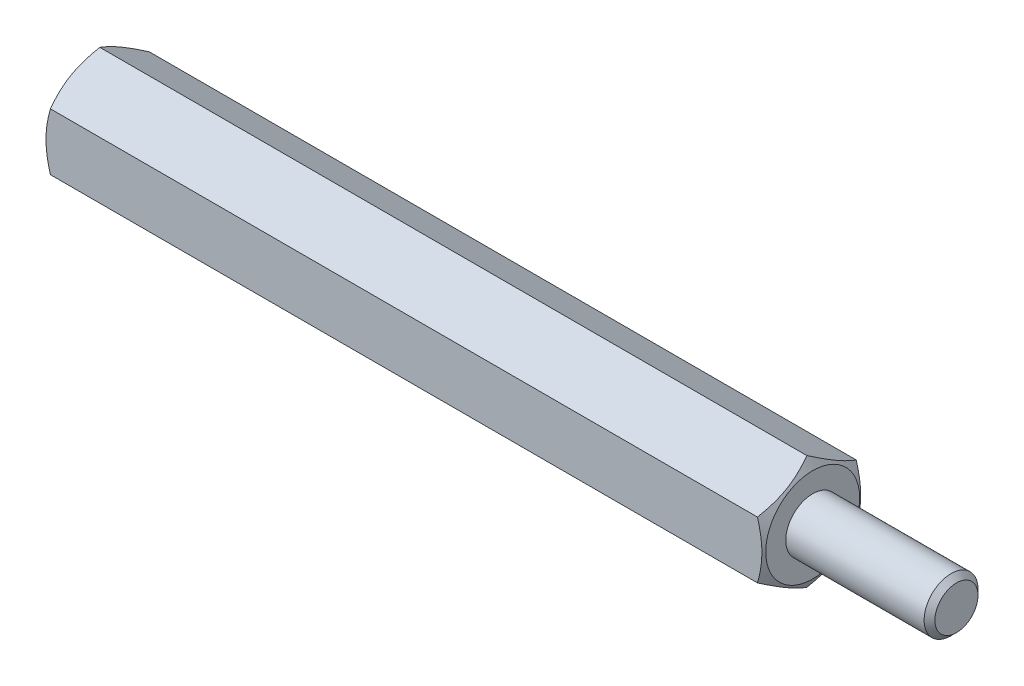
ISO-10303-21;
HEADER;
FILE_DESCRIPTION(('STEP AP214'),'2;1');
FILE_NAME('part.step','',(''),(''),'','','');
FILE_SCHEMA(('AUTOMOTIVE_DESIGN { 1 0 10303 214 1 1 1 1 }'));
ENDSEC;
DATA;
#1=APPLICATION_CONTEXT('core data for automotive mechanical design processes');
#2=APPLICATION_PROTOCOL_DEFINITION('international standard','automotive_design',2000,#1);
#3=PRODUCT_CONTEXT('',#1,'mechanical');
#4=PRODUCT('Part','Part','',(#3));
#5=PRODUCT_RELATED_PRODUCT_CATEGORY('part','',(#4));
#6=PRODUCT_DEFINITION_FORMATION('','',#4);
#7=PRODUCT_DEFINITION_CONTEXT('part definition',#1,'design');
#8=PRODUCT_DEFINITION('design','',#6,#7);
#9=PRODUCT_DEFINITION_SHAPE('','',#8);
#10=(LENGTH_UNIT() NAMED_UNIT(*) SI_UNIT(.MILLI.,.METRE.));
#11=(NAMED_UNIT(*) PLANE_ANGLE_UNIT() SI_UNIT($,.RADIAN.));
#12=(NAMED_UNIT(*) SI_UNIT($,.STERADIAN.) SOLID_ANGLE_UNIT());
#13=UNCERTAINTY_MEASURE_WITH_UNIT(LENGTH_MEASURE(1.E-05),#10,'distance_accuracy_value','');
#14=(GEOMETRIC_REPRESENTATION_CONTEXT(3) GLOBAL_UNCERTAINTY_ASSIGNED_CONTEXT((#13)) GLOBAL_UNIT_ASSIGNED_CONTEXT((#10,
#11,#12)) REPRESENTATION_CONTEXT('',''));
#15=CARTESIAN_POINT('',(0.,0.,0.));
#16=DIRECTION('',(0.,0.,1.));
#17=DIRECTION('',(1.,0.,0.));
#18=AXIS2_PLACEMENT_3D('',#15,#16,#17);
#19=CARTESIAN_POINT('',(40.,0.,0.));
#20=DIRECTION('',(1.,0.,0.));
#21=DIRECTION('',(0.,0.,-1.));
#22=AXIS2_PLACEMENT_3D('',#19,#20,#21);
#23=PLANE('',#22);
#24=CARTESIAN_POINT('',(40.,0.,0.));
#25=DIRECTION('',(1.,0.,0.));
#26=DIRECTION('',(0.,0.,-1.));
#27=AXIS2_PLACEMENT_3D('',#24,#25,#26);
#28=CIRCLE('',#27,1.5);
#29=CARTESIAN_POINT('',(40.,0.,-1.5));
#30=VERTEX_POINT('',#29);
#31=EDGE_CURVE('E120',#30,#30,#28,.T.);
#32=ORIENTED_EDGE('',*,*,#31,.F.);
#33=EDGE_LOOP('',(#32));
#34=FACE_BOUND('',#33,.T.);
#35=CARTESIAN_POINT('',(40.,0.,0.));
#36=DIRECTION('',(1.,0.,0.));
#37=DIRECTION('',(0.,0.,-1.));
#38=AXIS2_PLACEMENT_3D('',#35,#36,#37);
#39=CIRCLE('',#38,2.61250000000001);
#40=CARTESIAN_POINT('',(40.,0.,-2.61250000000001));
#41=VERTEX_POINT('',#40);
#42=EDGE_CURVE('E252',#41,#41,#39,.T.);
#43=ORIENTED_EDGE('',*,*,#42,.T.);
#44=EDGE_LOOP('',(#43));
#45=FACE_BOUND('',#44,.T.);
#46=ADVANCED_FACE('F33',(#34,#45),#23,.T.);
#47=CARTESIAN_POINT('',(48.,0.,0.));
#48=DIRECTION('',(-1.,0.,0.));
#49=DIRECTION('',(0.,0.,1.));
#50=AXIS2_PLACEMENT_3D('',#47,#48,#49);
#51=CYLINDRICAL_SURFACE('',#50,1.5);
#52=CARTESIAN_POINT('',(47.7,0.,0.));
#53=DIRECTION('',(1.,0.,0.));
#54=DIRECTION('',(0.,0.,-1.));
#55=AXIS2_PLACEMENT_3D('',#52,#53,#54);
#56=CIRCLE('',#55,1.5);
#57=CARTESIAN_POINT('',(47.7,0.,-1.5));
#58=VERTEX_POINT('',#57);
#59=EDGE_CURVE('E11',#58,#58,#56,.F.);
#60=ORIENTED_EDGE('',*,*,#59,.T.);
#61=EDGE_LOOP('',(#60));
#62=FACE_BOUND('',#61,.T.);
#63=ORIENTED_EDGE('',*,*,#31,.T.);
#64=EDGE_LOOP('',(#63));
#65=FACE_BOUND('',#64,.T.);
#66=ADVANCED_FACE('F229',(#62,#65),#51,.T.);
#67=CARTESIAN_POINT('',(48.,0.,0.));
#68=DIRECTION('',(1.,0.,0.));
#69=DIRECTION('',(0.,0.,-1.));
#70=AXIS2_PLACEMENT_3D('',#67,#68,#69);
#71=PLANE('',#70);
#72=CARTESIAN_POINT('',(48.,0.,0.));
#73=DIRECTION('',(1.,0.,0.));
#74=DIRECTION('',(0.,0.,-1.));
#75=AXIS2_PLACEMENT_3D('',#72,#73,#74);
#76=CIRCLE('',#75,1.20000000000001);
#77=CARTESIAN_POINT('',(48.,0.,-1.20000000000001));
#78=VERTEX_POINT('',#77);
#79=EDGE_CURVE('E41',#78,#78,#76,.T.);
#80=ORIENTED_EDGE('',*,*,#79,.T.);
#81=EDGE_LOOP('',(#80));
#82=FACE_BOUND('',#81,.T.);
#83=ADVANCED_FACE('F152',(#82),#71,.T.);
#84=CARTESIAN_POINT('',(40.,0.,0.));
#85=DIRECTION('',(-1.,0.,0.));
#86=DIRECTION('',(0.,0.,1.));
#87=AXIS2_PLACEMENT_3D('',#84,#85,#86);
#88=CONICAL_SURFACE('',#87,2.61250000000001,1.0471975511966);
#89=ORIENTED_EDGE('',*,*,#42,.F.);
#90=EDGE_LOOP('',(#89));
#91=FACE_BOUND('',#90,.T.);
#92=CARTESIAN_POINT('',(39.6749275746217,1.58759777021764,-2.7502));
#93=CARTESIAN_POINT('',(39.7152266757372,1.65737010029699,-2.62935077934009));
#94=CARTESIAN_POINT('',(39.7518774353888,1.72774469983534,-2.50745839737736));
#95=CARTESIAN_POINT('',(39.8158521550166,1.86971254687003,-2.2615628732721));
#96=CARTESIAN_POINT('',(39.8431534823119,1.94130831721583,-2.13755536142614));
#97=CARTESIAN_POINT('',(39.8856525926923,2.08361254889599,-1.89107720202405));
#98=CARTESIAN_POINT('',(39.901133219364,2.15429911309865,-1.76864448141258));
#99=CARTESIAN_POINT('',(39.9196149406165,2.29600490065923,-1.52320285763108));
#100=CARTESIAN_POINT('',(39.9226313385238,2.36702360884404,-1.40019484676708));
#101=CARTESIAN_POINT('',(39.9163611925579,2.49972966594897,-1.1703412133892));
#102=CARTESIAN_POINT('',(39.9086141837097,2.56143686540073,-1.06346120874598));
#103=CARTESIAN_POINT('',(39.8840591569221,2.68444923614047,-0.850397532665247));
#104=CARTESIAN_POINT('',(39.8672427483359,2.74575398185008,-0.744214598351107));
#105=CARTESIAN_POINT('',(39.8252024156405,2.86902004703207,-0.530711510606812));
#106=CARTESIAN_POINT('',(39.7998002572992,2.93096576264319,-0.423418383857141));
#107=CARTESIAN_POINT('',(39.7421471121464,3.05393320806134,-0.210432520715945));
#108=CARTESIAN_POINT('',(39.7099096746874,3.11495651365995,-0.104737054973344));
#109=CARTESIAN_POINT('',(39.6749275746217,3.17554195059678,0.000200000000003846));
#110=B_SPLINE_CURVE_WITH_KNOTS('',3,(#92,#93,#94,#95,#96,#97,#98,#99,#100,#101,#102,#103,#104,
#105,#106,#107,#108,#109),.UNSPECIFIED.,.F.,.F.,(4,2,2,2,2,2,2,2,4),(0.,0.435912828725887,
0.872873557116331,1.29901931904671,1.72464171213573,2.09526089052937,2.46622354066374,
2.84541551798557,3.22386274754524),.UNSPECIFIED.);
#111=CARTESIAN_POINT('',(39.6749942449246,1.58771324027148,-2.75));
#112=VERTEX_POINT('',#111);
#113=CARTESIAN_POINT('',(39.6749942449246,3.17542648054294,0.));
#114=VERTEX_POINT('',#113);
#115=EDGE_CURVE('E131',#112,#114,#110,.T.);
#116=ORIENTED_EDGE('',*,*,#115,.T.);
#117=CARTESIAN_POINT('',(39.6749275746217,3.17554195059678,-0.000199999999996213));
#118=CARTESIAN_POINT('',(39.7152266757372,3.10576962051743,0.12064922065991));
#119=CARTESIAN_POINT('',(39.7518774353888,3.03539502097908,0.242541602622638));
#120=CARTESIAN_POINT('',(39.8158521550166,2.89342717394439,0.488437126727898));
#121=CARTESIAN_POINT('',(39.8431534823119,2.82183140359858,0.612444638573861));
#122=CARTESIAN_POINT('',(39.8856525926923,2.67952717191842,0.85892279797595));
#123=CARTESIAN_POINT('',(39.901133219364,2.60884060771577,0.981355518587423));
#124=CARTESIAN_POINT('',(39.9196149406165,2.46713482015518,1.22679714236892));
#125=CARTESIAN_POINT('',(39.9226313385238,2.39611611197038,1.34980515323292));
#126=CARTESIAN_POINT('',(39.9163611925579,2.26341005486544,1.5796587866108));
#127=CARTESIAN_POINT('',(39.9086141837097,2.20170285541369,1.68653879125403));
#128=CARTESIAN_POINT('',(39.8840591569221,2.07869048467395,1.89960246733475));
#129=CARTESIAN_POINT('',(39.8672427483359,2.01738573896433,2.00578540164889));
#130=CARTESIAN_POINT('',(39.8252024156405,1.89411967378235,2.21928848939319));
#131=CARTESIAN_POINT('',(39.7998002572992,1.83217395817123,2.32658161614286));
#132=CARTESIAN_POINT('',(39.7421471121464,1.70920651275308,2.53956747928405));
#133=CARTESIAN_POINT('',(39.7099096746874,1.64818320715446,2.64526294502665));
#134=CARTESIAN_POINT('',(39.6749275746217,1.58759777021764,2.7502));
#135=B_SPLINE_CURVE_WITH_KNOTS('',3,(#117,#118,#119,#120,#121,#122,#123,#124,#125,#126,#127,
#128,#129,#130,#131,#132,#133,#134),.UNSPECIFIED.,.F.,.F.,(4,2,2,2,2,2,2,2,4),(0.,
0.43591282872589,0.872873557116335,1.29901931904672,1.72464171213574,2.09526089052938,
2.46622354066375,2.84541551798557,3.22386274754524),.UNSPECIFIED.);
#136=CARTESIAN_POINT('',(39.6749942449246,1.58771324027147,2.75));
#137=VERTEX_POINT('',#136);
#138=EDGE_CURVE('E139',#114,#137,#135,.T.);
#139=ORIENTED_EDGE('',*,*,#138,.T.);
#140=CARTESIAN_POINT('',(38.5576319326316,-4.30782014241011,2.75));
#141=CARTESIAN_POINT('',(38.6162836095867,-4.18726531654581,2.75));
#142=CARTESIAN_POINT('',(38.6743849240466,-4.06643816910979,2.75));
#143=CARTESIAN_POINT('',(38.7891778669407,-3.8240944166195,2.75));
#144=CARTESIAN_POINT('',(38.8458692806511,-3.7025777099667,2.75));
#145=CARTESIAN_POINT('',(38.9578090560797,-3.458105356063,2.75));
#146=CARTESIAN_POINT('',(39.0130482619427,-3.33514550230565,2.75));
#147=CARTESIAN_POINT('',(39.1213204698911,-3.08826186435015,2.75));
#148=CARTESIAN_POINT('',(39.1743535739049,-2.96433812500113,2.75));
#149=CARTESIAN_POINT('',(39.2792921273943,-2.7113269404381,2.75));
#150=CARTESIAN_POINT('',(39.3311065567683,-2.58220154142924,2.75));
#151=CARTESIAN_POINT('',(39.430916990516,-2.3224564886439,2.75));
#152=CARTESIAN_POINT('',(39.4789125727853,-2.19183667150655,2.75));
#153=CARTESIAN_POINT('',(39.5698579692354,-1.92912498594656,2.75));
#154=CARTESIAN_POINT('',(39.6128175918125,-1.79703654670007,2.75));
#155=CARTESIAN_POINT('',(39.6923417781181,-1.53096629694381,2.75));
#156=CARTESIAN_POINT('',(39.7289083094407,-1.39698508274037,2.75));
#157=CARTESIAN_POINT('',(39.7937438460925,-1.12772708047234,2.75));
#158=CARTESIAN_POINT('',(39.8220547897378,-0.992460577616631,2.75));
#159=CARTESIAN_POINT('',(39.8687813176856,-0.720203153927684,2.75));
#160=CARTESIAN_POINT('',(39.8871980675804,-0.583212438163357,2.75));
#161=CARTESIAN_POINT('',(39.9124291314624,-0.309989978008801,2.75));
#162=CARTESIAN_POINT('',(39.9193954911205,-0.173772629996251,2.75));
#163=CARTESIAN_POINT('',(39.9215379629552,0.0987726794769181,2.75));
#164=CARTESIAN_POINT('',(39.9167134971984,0.235100646032142,2.75));
#165=CARTESIAN_POINT('',(39.8989680753535,0.465158037199996,2.75));
#166=CARTESIAN_POINT('',(39.8889841108657,0.559128814459644,2.75));
#167=CARTESIAN_POINT('',(39.8640111201075,0.746408748148821,2.75));
#168=CARTESIAN_POINT('',(39.8490213815566,0.83971780849076,2.75));
#169=CARTESIAN_POINT('',(39.7973222369876,1.11853931619131,2.75));
#170=CARTESIAN_POINT('',(39.7538938441819,1.3028211512164,2.75));
#171=CARTESIAN_POINT('',(39.6782135831305,1.57867925827209,2.75));
#172=CARTESIAN_POINT('',(39.6508277417716,1.67167174830885,2.75));
#173=CARTESIAN_POINT('',(39.5931453490653,1.85669755112826,2.75));
#174=CARTESIAN_POINT('',(39.562850519184,1.94873139590001,2.75));
#175=CARTESIAN_POINT('',(39.4998214739185,2.13194851920638,2.75));
#176=CARTESIAN_POINT('',(39.4670873446708,2.22313182764732,2.75));
#177=CARTESIAN_POINT('',(39.3995759688816,2.40475072200258,2.75));
#178=CARTESIAN_POINT('',(39.3647984472483,2.49518620536278,2.75));
#179=CARTESIAN_POINT('',(39.286074979109,2.69425906745493,2.75));
#180=CARTESIAN_POINT('',(39.2417347386106,2.80274015419029,2.75));
#181=CARTESIAN_POINT('',(39.1510337491748,3.01885617108242,2.75));
#182=CARTESIAN_POINT('',(39.1046729095401,3.12649106300007,2.75));
#183=CARTESIAN_POINT('',(38.9631220023641,3.44835421203613,2.75));
#184=CARTESIAN_POINT('',(38.865478930226,3.66150285378818,2.75));
#185=CARTESIAN_POINT('',(38.6657085844919,4.08582350126589,2.75));
#186=CARTESIAN_POINT('',(38.5635786539451,4.29699424346803,2.75));
#187=CARTESIAN_POINT('',(38.3561807980291,4.71779425640231,2.75));
#188=CARTESIAN_POINT('',(38.2509127618966,4.92742347239813,2.75));
#189=CARTESIAN_POINT('',(38.037845903081,5.34602646409932,2.75));
#190=CARTESIAN_POINT('',(37.9300415771346,5.5549974298884,2.75));
#191=CARTESIAN_POINT('',(37.7127213552635,5.97205161125948,2.75));
#192=CARTESIAN_POINT('',(37.6032054225523,6.18013480763857,2.75));
#193=CARTESIAN_POINT('',(37.2728160121337,6.80319050465918,2.75));
#194=CARTESIAN_POINT('',(37.0500134395911,7.21713914846337,2.75));
#195=CARTESIAN_POINT('',(36.6349320787507,7.98131294129821,2.75));
#196=CARTESIAN_POINT('',(36.443091202704,8.33177707266852,2.75));
#197=CARTESIAN_POINT('',(36.0577699675954,9.03185646098386,2.75));
#198=CARTESIAN_POINT('',(35.8642894185863,9.38147161337288,2.75));
#199=CARTESIAN_POINT('',(35.4770176449484,10.0785196333477,2.75));
#200=CARTESIAN_POINT('',(35.2832315222264,10.425955339249,2.75));
#201=CARTESIAN_POINT('',(34.8948017372515,11.1202888046247,2.75));
#202=CARTESIAN_POINT('',(34.7001581879707,11.4671866272798,2.75));
#203=CARTESIAN_POINT('',(34.5052089419493,11.8139117951099,2.75));
#204=B_SPLINE_CURVE_WITH_KNOTS('',3,(#140,#141,#142,#143,#144,#145,#146,#147,#148,#149,#150,
#151,#152,#153,#154,#155,#156,#157,#158,#159,#160,#161,#162,#163,#164,#165,#166,#167,#168,#169,
#170,#171,#172,#173,#174,#175,#176,#177,#178,#179,#180,#181,#182,#183,#184,#185,#186,#187,#188,
#189,#190,#191,#192,#193,#194,#195,#196,#197,#198,#199,#200,#201,#202,#203),.UNSPECIFIED.,.F.,
.F.,(4,2,2,2,2,2,2,2,2,2,2,2,2,2,2,2,2,2,2,2,2,2,2,2,2,2,2,2,2,2,2,4),(0.,0.402200406174206,
0.804461695776014,1.20883826557491,1.61319613116903,2.03054962807288,2.44794919196405,
2.86452179433192,3.28096596207104,3.69525619374118,4.10949760895258,4.51819266601271,
4.92690775587314,5.21027047572884,5.49367353296154,6.06085418548302,6.3516516186458,
6.64227801348784,6.93289415059063,7.22354950196183,7.57510236122623,7.92667101670863,
8.62993150186772,9.33361419796498,10.0373217608381,10.7427306430188,11.4481547069671,
12.8584292219797,14.0570297519007,15.255771084781,16.4492444189717,17.6425649463424),.UNSPECIFIED.);
#205=CARTESIAN_POINT('',(39.6749942449246,-1.58771324027147,2.75));
#206=VERTEX_POINT('',#205);
#207=EDGE_CURVE('E179',#137,#206,#204,.F.);
#208=ORIENTED_EDGE('',*,*,#207,.T.);
#209=CARTESIAN_POINT('',(39.6749275746217,-1.58759777021763,2.7502));
#210=CARTESIAN_POINT('',(39.7152266757372,-1.65737010029699,2.62935077934009));
#211=CARTESIAN_POINT('',(39.7518774353888,-1.72774469983533,2.50745839737736));
#212=CARTESIAN_POINT('',(39.8158521550166,-1.86971254687003,2.26156287327211));
#213=CARTESIAN_POINT('',(39.8431534823119,-1.94130831721583,2.13755536142614));
#214=CARTESIAN_POINT('',(39.8856525926923,-2.08361254889599,1.89107720202405));
#215=CARTESIAN_POINT('',(39.901133219364,-2.15429911309864,1.76864448141258));
#216=CARTESIAN_POINT('',(39.9196149406165,-2.29600490065923,1.52320285763108));
#217=CARTESIAN_POINT('',(39.9226313385238,-2.36702360884404,1.40019484676709));
#218=CARTESIAN_POINT('',(39.9163611925579,-2.49972966594897,1.1703412133892));
#219=CARTESIAN_POINT('',(39.9086141837097,-2.56143686540073,1.06346120874598));
#220=CARTESIAN_POINT('',(39.8840591569221,-2.68444923614047,0.850397532665246));
#221=CARTESIAN_POINT('',(39.8672427483359,-2.74575398185008,0.744214598351106));
#222=CARTESIAN_POINT('',(39.8252024156405,-2.86902004703207,0.530711510606811));
#223=CARTESIAN_POINT('',(39.7998002572992,-2.93096576264319,0.423418383857139));
#224=CARTESIAN_POINT('',(39.7421471121464,-3.05393320806134,0.210432520715943));
#225=CARTESIAN_POINT('',(39.7099096746874,-3.11495651365995,0.104737054973342));
#226=CARTESIAN_POINT('',(39.6749275746217,-3.17554195059678,-0.000200000000005738));
#227=B_SPLINE_CURVE_WITH_KNOTS('',3,(#209,#210,#211,#212,#213,#214,#215,#216,#217,#218,#219,
#220,#221,#222,#223,#224,#225,#226),.UNSPECIFIED.,.F.,.F.,(4,2,2,2,2,2,2,2,4),(0.,
0.435912828725887,0.872873557116331,1.29901931904671,1.72464171213573,2.09526089052938,
2.46622354066375,2.84541551798558,3.22386274754525),.UNSPECIFIED.);
#228=CARTESIAN_POINT('',(39.6749942449246,-3.17542648054294,0.));
#229=VERTEX_POINT('',#228);
#230=EDGE_CURVE('E174',#206,#229,#227,.T.);
#231=ORIENTED_EDGE('',*,*,#230,.T.);
#232=CARTESIAN_POINT('',(39.6749275746217,-3.17554195059678,0.00019999999999511));
#233=CARTESIAN_POINT('',(39.7152266757372,-3.10576962051743,-0.120649220659911));
#234=CARTESIAN_POINT('',(39.7518774353888,-3.03539502097908,-0.242541602622639));
#235=CARTESIAN_POINT('',(39.8158521550166,-2.89342717394439,-0.488437126727898));
#236=CARTESIAN_POINT('',(39.8431534823119,-2.82183140359859,-0.612444638573861));
#237=CARTESIAN_POINT('',(39.8856525926923,-2.67952717191843,-0.85892279797595));
#238=CARTESIAN_POINT('',(39.901133219364,-2.60884060771577,-0.981355518587423));
#239=CARTESIAN_POINT('',(39.9196149406165,-2.46713482015519,-1.22679714236892));
#240=CARTESIAN_POINT('',(39.9226313385238,-2.39611611197038,-1.34980515323292));
#241=CARTESIAN_POINT('',(39.9163611925579,-2.26341005486544,-1.5796587866108));
#242=CARTESIAN_POINT('',(39.9086141837097,-2.20170285541369,-1.68653879125403));
#243=CARTESIAN_POINT('',(39.8840591569221,-2.07869048467395,-1.89960246733475));
#244=CARTESIAN_POINT('',(39.8672427483359,-2.01738573896434,-2.00578540164889));
#245=CARTESIAN_POINT('',(39.8252024156405,-1.89411967378235,-2.21928848939319));
#246=CARTESIAN_POINT('',(39.7998002572992,-1.83217395817123,-2.32658161614286));
#247=CARTESIAN_POINT('',(39.7421471121464,-1.70920651275308,-2.53956747928405));
#248=CARTESIAN_POINT('',(39.7099096746874,-1.64818320715447,-2.64526294502665));
#249=CARTESIAN_POINT('',(39.6749275746217,-1.58759777021764,-2.7502));
#250=B_SPLINE_CURVE_WITH_KNOTS('',3,(#232,#233,#234,#235,#236,#237,#238,#239,#240,#241,#242,
#243,#244,#245,#246,#247,#248,#249),.UNSPECIFIED.,.F.,.F.,(4,2,2,2,2,2,2,2,4),(0.,
0.435912828725889,0.872873557116334,1.29901931904672,1.72464171213574,2.09526089052938,
2.46622354066374,2.84541551798557,3.22386274754524),.UNSPECIFIED.);
#251=CARTESIAN_POINT('',(39.6749942449246,-1.58771324027148,-2.75));
#252=VERTEX_POINT('',#251);
#253=EDGE_CURVE('E48',#229,#252,#250,.T.);
#254=ORIENTED_EDGE('',*,*,#253,.T.);
#255=CARTESIAN_POINT('',(38.5576319321002,-4.30782014350211,-2.75));
#256=CARTESIAN_POINT('',(38.6162836090775,-4.18726531760098,-2.75));
#257=CARTESIAN_POINT('',(38.6743849235596,-4.06643817012811,-2.75));
#258=CARTESIAN_POINT('',(38.789177866498,-3.824094417564,-2.75));
#259=CARTESIAN_POINT('',(38.8458692802305,-3.70257771087424,-2.75));
#260=CARTESIAN_POINT('',(38.9578090557033,-3.45810535689603,-2.75));
#261=CARTESIAN_POINT('',(39.0130482615885,-3.33514550310114,-2.75));
#262=CARTESIAN_POINT('',(39.1213204695807,-3.08826186507031,-2.75));
#263=CARTESIAN_POINT('',(39.1743535736162,-2.9643381256835,-2.75));
#264=CARTESIAN_POINT('',(39.2792921271496,-2.71132694104215,-2.75));
#265=CARTESIAN_POINT('',(39.3311065565458,-2.58220154199273,-2.75));
#266=CARTESIAN_POINT('',(39.4309169903368,-2.32245648912563,-2.75));
#267=CARTESIAN_POINT('',(39.4789125726271,-2.19183667194707,-2.75));
#268=CARTESIAN_POINT('',(39.5698579691173,-1.9291249863039,-2.75));
#269=CARTESIAN_POINT('',(39.6128175917135,-1.79703654701544,-2.75));
#270=CARTESIAN_POINT('',(39.692341778054,-1.53096629717411,-2.75));
#271=CARTESIAN_POINT('',(39.7289083093926,-1.39698508292755,-2.75));
#272=CARTESIAN_POINT('',(39.7937438460766,-1.12772708055107,-2.75));
#273=CARTESIAN_POINT('',(39.8220547897369,-0.992460577629728,-2.75));
#274=CARTESIAN_POINT('',(39.8687813177048,-0.720203153807918,-2.75));
#275=CARTESIAN_POINT('',(39.8871980676048,-0.583212437976368,-2.75));
#276=CARTESIAN_POINT('',(39.912429131485,-0.309989977688433,-2.75));
#277=CARTESIAN_POINT('',(39.9193954911365,-0.173772629609739,-2.75));
#278=CARTESIAN_POINT('',(39.9215379629464,0.0987726799947071,-2.75));
#279=CARTESIAN_POINT('',(39.9167134971713,0.235100646615066,-2.75));
#280=CARTESIAN_POINT('',(39.8989680752897,0.465158037864656,-2.75));
#281=CARTESIAN_POINT('',(39.8889841107874,0.559128815141642,-2.75));
#282=CARTESIAN_POINT('',(39.8640111199994,0.746408748864722,-2.75));
#283=CARTESIAN_POINT('',(39.8490213814332,0.839717809223226,-2.75));
#284=CARTESIAN_POINT('',(39.7973222368179,1.11853931697259,-2.75));
#285=CARTESIAN_POINT('',(39.7538938439809,1.30282115202895,-2.75));
#286=CARTESIAN_POINT('',(39.6782135828835,1.57867925913148,-2.75));
#287=CARTESIAN_POINT('',(39.6508277415091,1.67167174918422,-2.75));
#288=CARTESIAN_POINT('',(39.5931453487722,1.8566975520354,-2.75));
#289=CARTESIAN_POINT('',(39.5628505188759,1.94873139682293,-2.75));
#290=CARTESIAN_POINT('',(39.4998214735808,2.13194852016075,-2.75));
#291=CARTESIAN_POINT('',(39.4670873443186,2.22313182861737,-2.75));
#292=CARTESIAN_POINT('',(39.399575968501,2.40475072300397,-2.75));
#293=CARTESIAN_POINT('',(39.3647984468537,2.49518620637985,-2.75));
#294=CARTESIAN_POINT('',(39.2860749786937,2.69425906848206,-2.75));
#295=CARTESIAN_POINT('',(39.2417347381892,2.80274015521203,-2.74999999999999));
#296=CARTESIAN_POINT('',(39.1510337487429,3.01885617209383,-2.74999999999999));
#297=CARTESIAN_POINT('',(39.1046729091036,3.12649106400654,-2.74999999999999));
#298=CARTESIAN_POINT('',(38.9631220019155,3.44835421302831,-2.74999999999999));
#299=CARTESIAN_POINT('',(38.8654789297715,3.6615028547716,-2.74999999999999));
#300=CARTESIAN_POINT('',(38.6657085840283,4.08582350223268,-2.74999999999999));
#301=CARTESIAN_POINT('',(38.5635786534784,4.29699424442698,-2.74999999999999));
#302=CARTESIAN_POINT('',(38.3561807975579,4.71779425734631,-2.74999999999999));
#303=CARTESIAN_POINT('',(38.2509127614241,4.92742347333505,-2.74999999999999));
#304=CARTESIAN_POINT('',(38.0378459026071,5.34602646502202,-2.74999999999999));
#305=CARTESIAN_POINT('',(37.9300415766607,5.55499743080397,-2.74999999999999));
#306=CARTESIAN_POINT('',(37.7127213547904,5.97205161216118,-2.74999999999999));
#307=CARTESIAN_POINT('',(37.6032054220802,6.18013480853354,-2.74999999999999));
#308=CARTESIAN_POINT('',(37.2728160116647,6.80319050553456,-2.74999999999999));
#309=CARTESIAN_POINT('',(37.0500134391253,7.21713914932632,-2.74999999999999));
#310=CARTESIAN_POINT('',(36.6349320782842,7.98131294215253,-2.74999999999999));
#311=CARTESIAN_POINT('',(36.4430912022335,8.33177707352651,-2.74999999999999));
#312=CARTESIAN_POINT('',(36.0577699671173,9.03185646184937,-2.74999999999999));
#313=CARTESIAN_POINT('',(35.8642894181045,9.38147161424223,-2.74999999999999));
#314=CARTESIAN_POINT('',(35.4770176444588,10.0785196342265,-2.74999999999999));
#315=CARTESIAN_POINT('',(35.2832315217326,10.4259553401334,-2.74999999999999));
#316=CARTESIAN_POINT('',(34.8948017367494,11.1202888055205,-2.74999999999999));
#317=CARTESIAN_POINT('',(34.7001581874645,11.4671866281813,-2.74999999999999));
#318=CARTESIAN_POINT('',(34.5052089414391,11.8139117960172,-2.74999999999999));
#319=B_SPLINE_CURVE_WITH_KNOTS('',3,(#255,#256,#257,#258,#259,#260,#261,#262,#263,#264,#265,
#266,#267,#268,#269,#270,#271,#272,#273,#274,#275,#276,#277,#278,#279,#280,#281,#282,#283,#284,
#285,#286,#287,#288,#289,#290,#291,#292,#293,#294,#295,#296,#297,#298,#299,#300,#301,#302,#303,
#304,#305,#306,#307,#308,#309,#310,#311,#312,#313,#314,#315,#316,#317,#318),.UNSPECIFIED.,.F.,
.F.,(4,2,2,2,2,2,2,2,2,2,2,2,2,2,2,2,2,2,2,2,2,2,2,2,2,2,2,2,2,2,2,4),(0.,0.402200406302721,
0.804461696033063,1.20883826596186,1.61319613168587,2.03054962872746,2.4479491927564,
2.8645217952616,3.28096596313794,3.69525619500961,4.10949761042226,4.51819266767878,
4.9269077577357,5.21027047764772,5.49367353493675,6.06085418757121,6.35165162079316,
6.6422780156943,6.93289415285604,7.22354950428623,7.57510236354251,7.92667101901677,
8.62993150415942,9.33361420023959,10.0373217630956,10.7427306452573,11.4481547091865,
12.8584292241618,14.0570297540983,15.2557710869939,16.4492444212054,17.6425649485972),.UNSPECIFIED.);
#320=EDGE_CURVE('E104',#252,#112,#319,.T.);
#321=ORIENTED_EDGE('',*,*,#320,.T.);
#322=EDGE_LOOP('',(#116,#139,#208,#231,#254,#321));
#323=FACE_BOUND('',#322,.T.);
#324=ADVANCED_FACE('F147',(#91,#323),#88,.T.);
#325=CARTESIAN_POINT('',(40.,-1.58771324027148,-2.75));
#326=DIRECTION('',(0.,0.,1.));
#327=DIRECTION('',(0.,-1.,0.));
#328=AXIS2_PLACEMENT_3D('',#325,#326,#327);
#329=PLANE('',#328);
#330=DIRECTION('',(-1.,0.,0.));
#331=VECTOR('',#330,1.);
#332=CARTESIAN_POINT('',(40.,-1.58771324027148,-2.75));
#333=LINE('',#332,#331);
#334=CARTESIAN_POINT('',(0.325005755075304,-1.58771324027167,-2.75));
#335=VERTEX_POINT('',#334);
#336=EDGE_CURVE('E98',#252,#335,#333,.T.);
#337=ORIENTED_EDGE('',*,*,#336,.T.);
#338=CARTESIAN_POINT('',(1.44236806789984,-4.30782014350212,-2.75));
#339=CARTESIAN_POINT('',(1.38371639092254,-4.18726531760099,-2.75));
#340=CARTESIAN_POINT('',(1.32561507644045,-4.06643817012812,-2.75));
#341=CARTESIAN_POINT('',(1.21082213350203,-3.824094417564,-2.75));
#342=CARTESIAN_POINT('',(1.15413071976949,-3.70257771087424,-2.75));
#343=CARTESIAN_POINT('',(1.04219094429671,-3.45810535689603,-2.75));
#344=CARTESIAN_POINT('',(0.98695173841154,-3.33514550310114,-2.75));
#345=CARTESIAN_POINT('',(0.878679530419349,-3.08826186507032,-2.75));
#346=CARTESIAN_POINT('',(0.825646426383825,-2.9643381256835,-2.75));
#347=CARTESIAN_POINT('',(0.720707872850375,-2.71132694104215,-2.75));
#348=CARTESIAN_POINT('',(0.668893443454169,-2.58220154199273,-2.75));
#349=CARTESIAN_POINT('',(0.56908300966316,-2.32245648912563,-2.75));
#350=CARTESIAN_POINT('',(0.521087427372889,-2.19183667194707,-2.75));
#351=CARTESIAN_POINT('',(0.430142030882725,-1.9291249863039,-2.75));
#352=CARTESIAN_POINT('',(0.387182408286516,-1.79703654701544,-2.75));
#353=CARTESIAN_POINT('',(0.307658221946016,-1.53096629717411,-2.75));
#354=CARTESIAN_POINT('',(0.271091690607389,-1.39698508292755,-2.75));
#355=CARTESIAN_POINT('',(0.206256153923405,-1.12772708055107,-2.75));
#356=CARTESIAN_POINT('',(0.17794521026309,-0.992460577629727,-2.75));
#357=CARTESIAN_POINT('',(0.131218682295206,-0.720203153807916,-2.75));
#358=CARTESIAN_POINT('',(0.11280193239521,-0.583212437976367,-2.75));
#359=CARTESIAN_POINT('',(0.087570868514987,-0.309989977688431,-2.75));
#360=CARTESIAN_POINT('',(0.0806045088634958,-0.173772629609737,-2.75));
#361=CARTESIAN_POINT('',(0.078462037053641,0.0987726799947109,-2.75));
#362=CARTESIAN_POINT('',(0.0832865028286562,0.23510064661507,-2.75));
#363=CARTESIAN_POINT('',(0.101031924710265,0.465158037864661,-2.75));
#364=CARTESIAN_POINT('',(0.111015889212559,0.559128815141647,-2.75));
#365=CARTESIAN_POINT('',(0.135988880000603,0.746408748864728,-2.75));
#366=CARTESIAN_POINT('',(0.150978618566838,0.839717809223232,-2.75));
#367=CARTESIAN_POINT('',(0.20267776318206,1.1185393169726,-2.75));
#368=CARTESIAN_POINT('',(0.246106156019073,1.30282115202896,-2.75));
#369=CARTESIAN_POINT('',(0.321786417116547,1.57867925913149,-2.75));
#370=CARTESIAN_POINT('',(0.349172258490935,1.67167174918423,-2.75));
#371=CARTESIAN_POINT('',(0.406854651227838,1.85669755203541,-2.75));
#372=CARTESIAN_POINT('',(0.437149481124149,1.94873139682294,-2.75));
#373=CARTESIAN_POINT('',(0.500178526419205,2.13194852016076,-2.75));
#374=CARTESIAN_POINT('',(0.532912655681421,2.22313182861738,-2.75));
#375=CARTESIAN_POINT('',(0.600424031499047,2.40475072300398,-2.75));
#376=CARTESIAN_POINT('',(0.635201553146344,2.49518620637986,-2.75));
#377=CARTESIAN_POINT('',(0.713925021306319,2.69425906848207,-2.75));
#378=CARTESIAN_POINT('',(0.75826526181078,2.80274015521204,-2.74999999999999));
#379=CARTESIAN_POINT('',(0.848966251257138,3.01885617209384,-2.74999999999999));
#380=CARTESIAN_POINT('',(0.895327090896407,3.12649106400656,-2.74999999999999));
#381=CARTESIAN_POINT('',(1.03687799808455,3.44835421302832,-2.74999999999999));
#382=CARTESIAN_POINT('',(1.13452107022851,3.66150285477161,-2.74999999999999));
#383=CARTESIAN_POINT('',(1.33429141597171,4.08582350223269,-2.74999999999999));
#384=CARTESIAN_POINT('',(1.43642134652157,4.29699424442699,-2.74999999999999));
#385=CARTESIAN_POINT('',(1.64381920244215,4.71779425734633,-2.74999999999999));
#386=CARTESIAN_POINT('',(1.74908723857596,4.92742347333506,-2.74999999999999));
#387=CARTESIAN_POINT('',(1.96215409739296,5.34602646502203,-2.74999999999999));
#388=CARTESIAN_POINT('',(2.06995842333932,5.55499743080399,-2.74999999999999));
#389=CARTESIAN_POINT('',(2.28727864520958,5.97205161216119,-2.74999999999999));
#390=CARTESIAN_POINT('',(2.39679457791986,6.18013480853355,-2.74999999999999));
#391=CARTESIAN_POINT('',(2.7271839883353,6.80319050553457,-2.74999999999999));
#392=CARTESIAN_POINT('',(2.94998656087477,7.21713914932633,-2.74999999999999));
#393=CARTESIAN_POINT('',(3.36506792171577,7.98131294215254,-2.74999999999999));
#394=CARTESIAN_POINT('',(3.55690879776654,8.33177707352653,-2.74999999999999));
#395=CARTESIAN_POINT('',(3.94223003288275,9.03185646184938,-2.74999999999999));
#396=CARTESIAN_POINT('',(4.13571058189547,9.38147161424225,-2.74999999999999));
#397=CARTESIAN_POINT('',(4.52298235554117,10.0785196342265,-2.74999999999999));
#398=CARTESIAN_POINT('',(4.71676847826737,10.4259553401334,-2.74999999999999));
#399=CARTESIAN_POINT('',(5.1051982632506,11.1202888055205,-2.74999999999999));
#400=CARTESIAN_POINT('',(5.29984181253548,11.4671866281813,-2.74999999999999));
#401=CARTESIAN_POINT('',(5.49479105856088,11.8139117960173,-2.74999999999999));
#402=B_SPLINE_CURVE_WITH_KNOTS('',3,(#338,#339,#340,#341,#342,#343,#344,#345,#346,#347,#348,
#349,#350,#351,#352,#353,#354,#355,#356,#357,#358,#359,#360,#361,#362,#363,#364,#365,#366,#367,
#368,#369,#370,#371,#372,#373,#374,#375,#376,#377,#378,#379,#380,#381,#382,#383,#384,#385,#386,
#387,#388,#389,#390,#391,#392,#393,#394,#395,#396,#397,#398,#399,#400,#401),.UNSPECIFIED.,.F.,
.F.,(4,2,2,2,2,2,2,2,2,2,2,2,2,2,2,2,2,2,2,2,2,2,2,2,2,2,2,2,2,2,2,4),(0.,0.402200406302722,
0.804461696033069,1.20883826596187,1.61319613168587,2.03054962872746,2.44794919275641,
2.86452179526161,3.28096596313794,3.69525619500962,4.10949761042228,4.51819266767879,
4.92690775773572,5.21027047764774,5.49367353493677,6.06085418757123,6.35165162079318,
6.64227801569432,6.93289415285606,7.22354950428625,7.57510236354254,7.9266710190168,
8.62993150415945,9.33361420023962,10.0373217630956,10.7427306452573,11.4481547091865,
12.8584292241618,14.0570297540983,15.2557710869939,16.4492444212055,17.6425649485972),.UNSPECIFIED.);
#403=CARTESIAN_POINT('',(0.325005755075435,1.58771324027148,-2.75));
#404=VERTEX_POINT('',#403);
#405=EDGE_CURVE('E83',#335,#404,#402,.T.);
#406=ORIENTED_EDGE('',*,*,#405,.T.);
#407=DIRECTION('',(-1.,0.,0.));
#408=VECTOR('',#407,1.);
#409=CARTESIAN_POINT('',(40.,1.58771324027148,-2.75));
#410=LINE('',#409,#408);
#411=EDGE_CURVE('E105',#112,#404,#410,.T.);
#412=ORIENTED_EDGE('',*,*,#411,.F.);
#413=ORIENTED_EDGE('',*,*,#320,.F.);
#414=EDGE_LOOP('',(#337,#406,#412,#413));
#415=FACE_BOUND('',#414,.T.);
#416=ADVANCED_FACE('F103',(#415),#329,.F.);
#417=CARTESIAN_POINT('',(40.,-3.17542648054294,0.));
#418=DIRECTION('',(0.,0.866025403784438,0.5));
#419=DIRECTION('',(0.,-0.5,0.866025403784438));
#420=AXIS2_PLACEMENT_3D('',#417,#418,#419);
#421=PLANE('',#420);
#422=DIRECTION('',(-1.,0.,0.));
#423=VECTOR('',#422,1.);
#424=CARTESIAN_POINT('',(40.,-3.17542648054294,0.));
#425=LINE('',#424,#423);
#426=CARTESIAN_POINT('',(0.325005755075438,-3.17542648054294,0.));
#427=VERTEX_POINT('',#426);
#428=EDGE_CURVE('E100',#229,#427,#425,.T.);
#429=ORIENTED_EDGE('',*,*,#428,.T.);
#430=CARTESIAN_POINT('',(0.325072425378336,-3.17554195059678,0.000199999999995148));
#431=CARTESIAN_POINT('',(0.284773324262838,-3.10576962051743,-0.120649220659911));
#432=CARTESIAN_POINT('',(0.248122564611237,-3.03539502097908,-0.242541602622639));
#433=CARTESIAN_POINT('',(0.184147844983376,-2.89342717394439,-0.488437126727898));
#434=CARTESIAN_POINT('',(0.156846517688073,-2.82183140359859,-0.612444638573861));
#435=CARTESIAN_POINT('',(0.114347407307692,-2.67952717191843,-0.85892279797595));
#436=CARTESIAN_POINT('',(0.0988667806360331,-2.60884060771577,-0.981355518587423));
#437=CARTESIAN_POINT('',(0.0803850593835159,-2.46713482015519,-1.22679714236892));
#438=CARTESIAN_POINT('',(0.0773686614761752,-2.39611611197038,-1.34980515323292));
#439=CARTESIAN_POINT('',(0.0836388074421224,-2.26341005486544,-1.5796587866108));
#440=CARTESIAN_POINT('',(0.0913858162902782,-2.20170285541369,-1.68653879125403));
#441=CARTESIAN_POINT('',(0.115940843077931,-2.07869048467395,-1.89960246733475));
#442=CARTESIAN_POINT('',(0.132757251664146,-2.01738573896434,-2.00578540164889));
#443=CARTESIAN_POINT('',(0.174797584359532,-1.89411967378235,-2.21928848939318));
#444=CARTESIAN_POINT('',(0.200199742700806,-1.83217395817123,-2.32658161614285));
#445=CARTESIAN_POINT('',(0.257852887853556,-1.70920651275308,-2.53956747928405));
#446=CARTESIAN_POINT('',(0.290090325312557,-1.64818320715447,-2.64526294502665));
#447=CARTESIAN_POINT('',(0.325072425378334,-1.58759777021764,-2.7502));
#448=B_SPLINE_CURVE_WITH_KNOTS('',3,(#430,#431,#432,#433,#434,#435,#436,#437,#438,#439,#440,
#441,#442,#443,#444,#445,#446,#447),.UNSPECIFIED.,.F.,.F.,(4,2,2,2,2,2,2,2,4),(0.,
0.435912828725889,0.872873557116333,1.29901931904672,1.72464171213574,2.09526089052938,
2.46622354066374,2.84541551798557,3.22386274754524),.UNSPECIFIED.);
#449=EDGE_CURVE('E86',#427,#335,#448,.T.);
#450=ORIENTED_EDGE('',*,*,#449,.T.);
#451=ORIENTED_EDGE('',*,*,#336,.F.);
#452=ORIENTED_EDGE('',*,*,#253,.F.);
#453=EDGE_LOOP('',(#429,#450,#451,#452));
#454=FACE_BOUND('',#453,.T.);
#455=ADVANCED_FACE('F97',(#454),#421,.F.);
#456=CARTESIAN_POINT('',(40.,-1.58771324027147,2.75));
#457=DIRECTION('',(0.,0.866025403784439,-0.5));
#458=DIRECTION('',(0.,0.5,0.866025403784439));
#459=AXIS2_PLACEMENT_3D('',#456,#457,#458);
#460=PLANE('',#459);
#461=DIRECTION('',(-1.,0.,0.));
#462=VECTOR('',#461,1.);
#463=CARTESIAN_POINT('',(40.,-1.58771324027147,2.75));
#464=LINE('',#463,#462);
#465=CARTESIAN_POINT('',(0.325005755075436,-1.58771324027147,2.75));
#466=VERTEX_POINT('',#465);
#467=EDGE_CURVE('E107',#206,#466,#464,.T.);
#468=ORIENTED_EDGE('',*,*,#467,.T.);
#469=CARTESIAN_POINT('',(0.325072425378334,-1.58759777021763,2.7502));
#470=CARTESIAN_POINT('',(0.284773324262837,-1.65737010029699,2.62935077934009));
#471=CARTESIAN_POINT('',(0.248122564611236,-1.72774469983533,2.50745839737737));
#472=CARTESIAN_POINT('',(0.184147844983374,-1.86971254687003,2.26156287327211));
#473=CARTESIAN_POINT('',(0.156846517688071,-1.94130831721583,2.13755536142614));
#474=CARTESIAN_POINT('',(0.11434740730769,-2.08361254889599,1.89107720202405));
#475=CARTESIAN_POINT('',(0.0988667806360311,-2.15429911309864,1.76864448141258));
#476=CARTESIAN_POINT('',(0.0803850593835137,-2.29600490065923,1.52320285763108));
#477=CARTESIAN_POINT('',(0.0773686614761731,-2.36702360884404,1.40019484676709));
#478=CARTESIAN_POINT('',(0.0836388074421203,-2.49972966594897,1.1703412133892));
#479=CARTESIAN_POINT('',(0.0913858162902761,-2.56143686540073,1.06346120874598));
#480=CARTESIAN_POINT('',(0.115940843077929,-2.68444923614047,0.850397532665247));
#481=CARTESIAN_POINT('',(0.132757251664144,-2.74575398185008,0.744214598351107));
#482=CARTESIAN_POINT('',(0.174797584359531,-2.86902004703207,0.530711510606812));
#483=CARTESIAN_POINT('',(0.200199742700805,-2.93096576264319,0.423418383857141));
#484=CARTESIAN_POINT('',(0.257852887853557,-3.05393320806134,0.210432520715944));
#485=CARTESIAN_POINT('',(0.290090325312558,-3.11495651365995,0.104737054973343));
#486=CARTESIAN_POINT('',(0.325072425378336,-3.17554195059678,-0.00020000000000501));
#487=B_SPLINE_CURVE_WITH_KNOTS('',3,(#469,#470,#471,#472,#473,#474,#475,#476,#477,#478,#479,
#480,#481,#482,#483,#484,#485,#486),.UNSPECIFIED.,.F.,.F.,(4,2,2,2,2,2,2,2,4),(0.,
0.435912828725888,0.872873557116333,1.29901931904672,1.72464171213574,2.09526089052938,
2.46622354066375,2.84541551798558,3.22386274754525),.UNSPECIFIED.);
#488=EDGE_CURVE('E101',#466,#427,#487,.T.);
#489=ORIENTED_EDGE('',*,*,#488,.T.);
#490=ORIENTED_EDGE('',*,*,#428,.F.);
#491=ORIENTED_EDGE('',*,*,#230,.F.);
#492=EDGE_LOOP('',(#468,#489,#490,#491));
#493=FACE_BOUND('',#492,.T.);
#494=ADVANCED_FACE('F188',(#493),#460,.F.);
#495=CARTESIAN_POINT('',(40.,1.58771324027147,2.75));
#496=DIRECTION('',(0.,0.,-1.));
#497=DIRECTION('',(-1.,0.,0.));
#498=AXIS2_PLACEMENT_3D('',#495,#496,#497);
#499=PLANE('',#498);
#500=DIRECTION('',(-1.,0.,0.));
#501=VECTOR('',#500,1.);
#502=CARTESIAN_POINT('',(40.,1.58771324027147,2.75));
#503=LINE('',#502,#501);
#504=CARTESIAN_POINT('',(0.325005755075436,1.58771324027147,2.75));
#505=VERTEX_POINT('',#504);
#506=EDGE_CURVE('E115',#137,#505,#503,.T.);
#507=ORIENTED_EDGE('',*,*,#506,.T.);
#508=CARTESIAN_POINT('',(1.44236806736841,-4.30782014241011,2.75));
#509=CARTESIAN_POINT('',(1.38371639041334,-4.18726531654581,2.75));
#510=CARTESIAN_POINT('',(1.32561507595345,-4.06643816910979,2.75));
#511=CARTESIAN_POINT('',(1.21082213305934,-3.8240944166195,2.75));
#512=CARTESIAN_POINT('',(1.1541307193489,-3.7025777099667,2.75));
#513=CARTESIAN_POINT('',(1.04219094392033,-3.458105356063,2.75));
#514=CARTESIAN_POINT('',(0.986951738057271,-3.33514550230565,2.75));
#515=CARTESIAN_POINT('',(0.878679530108924,-3.08826186435015,2.75));
#516=CARTESIAN_POINT('',(0.825646426095137,-2.96433812500113,2.75));
#517=CARTESIAN_POINT('',(0.720707872605697,-2.7113269404381,2.75));
#518=CARTESIAN_POINT('',(0.668893443231718,-2.58220154142924,2.75));
#519=CARTESIAN_POINT('',(0.569083009483976,-2.32245648864391,2.75));
#520=CARTESIAN_POINT('',(0.521087427214747,-2.19183667150655,2.75));
#521=CARTESIAN_POINT('',(0.430142030764656,-1.92912498594656,2.75));
#522=CARTESIAN_POINT('',(0.387182408187483,-1.79703654670007,2.75));
#523=CARTESIAN_POINT('',(0.307658221881957,-1.53096629694382,2.75));
#524=CARTESIAN_POINT('',(0.271091690559267,-1.39698508274037,2.75));
#525=CARTESIAN_POINT('',(0.206256153907478,-1.12772708047234,2.75));
#526=CARTESIAN_POINT('',(0.17794521026218,-0.992460577616632,2.75));
#527=CARTESIAN_POINT('',(0.131218682314428,-0.720203153927684,2.75));
#528=CARTESIAN_POINT('',(0.112801932419557,-0.583212438163357,2.75));
#529=CARTESIAN_POINT('',(0.0875708685376005,-0.3099899780088,2.75));
#530=CARTESIAN_POINT('',(0.0806045088794706,-0.17377262999625,2.75));
#531=CARTESIAN_POINT('',(0.0784620370447877,0.0987726794769202,2.75));
#532=CARTESIAN_POINT('',(0.0832865028016105,0.235100646032145,2.75));
#533=CARTESIAN_POINT('',(0.101031924646524,0.465158037200001,2.75));
#534=CARTESIAN_POINT('',(0.111015889134282,0.559128814459649,2.75));
#535=CARTESIAN_POINT('',(0.135988879892486,0.746408748148828,2.75));
#536=CARTESIAN_POINT('',(0.150978618443414,0.839717808490768,2.75));
#537=CARTESIAN_POINT('',(0.202677763012389,1.11853931619132,2.75));
#538=CARTESIAN_POINT('',(0.246106155818158,1.30282115121641,2.75));
#539=CARTESIAN_POINT('',(0.321786416869488,1.5786792582721,2.75));
#540=CARTESIAN_POINT('',(0.349172258228362,1.67167174830886,2.75));
#541=CARTESIAN_POINT('',(0.406854650934721,1.85669755112827,2.75));
#542=CARTESIAN_POINT('',(0.437149480816003,1.94873139590001,2.75));
#543=CARTESIAN_POINT('',(0.500178526081535,2.13194851920638,2.75));
#544=CARTESIAN_POINT('',(0.532912655329257,2.22313182764733,2.75));
#545=CARTESIAN_POINT('',(0.600424031118393,2.40475072200258,2.75));
#546=CARTESIAN_POINT('',(0.635201552751694,2.49518620536279,2.75));
#547=CARTESIAN_POINT('',(0.713925020890995,2.69425906745494,2.75));
#548=CARTESIAN_POINT('',(0.758265261389449,2.8027401541903,2.75));
#549=CARTESIAN_POINT('',(0.848966250825205,3.01885617108242,2.75));
#550=CARTESIAN_POINT('',(0.895327090459879,3.12649106300008,2.75));
#551=CARTESIAN_POINT('',(1.03687799763589,3.44835421203613,2.75));
#552=CARTESIAN_POINT('',(1.13452106977397,3.66150285378819,2.75));
#553=CARTESIAN_POINT('',(1.33429141550814,4.0858235012659,2.75));
#554=CARTESIAN_POINT('',(1.43642134605488,4.29699424346804,2.75));
#555=CARTESIAN_POINT('',(1.64381920197094,4.71779425640232,2.75));
#556=CARTESIAN_POINT('',(1.74908723810337,4.92742347239814,2.75));
#557=CARTESIAN_POINT('',(1.96215409691901,5.34602646409933,2.75));
#558=CARTESIAN_POINT('',(2.06995842286541,5.55499742988841,2.75));
#559=CARTESIAN_POINT('',(2.28727864473655,5.97205161125948,2.75));
#560=CARTESIAN_POINT('',(2.39679457744766,6.18013480763858,2.75));
#561=CARTESIAN_POINT('',(2.72718398786629,6.80319050465919,2.75));
#562=CARTESIAN_POINT('',(2.94998656040893,7.21713914846338,2.75));
#563=CARTESIAN_POINT('',(3.3650679212493,7.98131294129822,2.75));
#564=CARTESIAN_POINT('',(3.55690879729604,8.33177707266853,2.75));
#565=CARTESIAN_POINT('',(3.94223003240463,9.03185646098387,2.75));
#566=CARTESIAN_POINT('',(4.13571058141376,9.38147161337289,2.75));
#567=CARTESIAN_POINT('',(4.52298235505163,10.0785196333477,2.75));
#568=CARTESIAN_POINT('',(4.71676847777359,10.425955339249,2.75));
#569=CARTESIAN_POINT('',(5.1051982627485,11.1202888046247,2.75));
#570=CARTESIAN_POINT('',(5.2998418120293,11.4671866272798,2.75));
#571=CARTESIAN_POINT('',(5.49479105805066,11.8139117951099,2.75));
#572=B_SPLINE_CURVE_WITH_KNOTS('',3,(#508,#509,#510,#511,#512,#513,#514,#515,#516,#517,#518,
#519,#520,#521,#522,#523,#524,#525,#526,#527,#528,#529,#530,#531,#532,#533,#534,#535,#536,#537,
#538,#539,#540,#541,#542,#543,#544,#545,#546,#547,#548,#549,#550,#551,#552,#553,#554,#555,#556,
#557,#558,#559,#560,#561,#562,#563,#564,#565,#566,#567,#568,#569,#570,#571),.UNSPECIFIED.,.F.,
.F.,(4,2,2,2,2,2,2,2,2,2,2,2,2,2,2,2,2,2,2,2,2,2,2,2,2,2,2,2,2,2,2,4),(0.,0.402200406174206,
0.804461695776016,1.20883826557491,1.61319613116903,2.03054962807288,2.44794919196405,
2.86452179433192,3.28096596207104,3.69525619374118,4.10949760895259,4.51819266601271,
4.92690775587315,5.21027047572885,5.49367353296155,6.06085418548304,6.35165161864581,
6.64227801348785,6.93289415059065,7.22354950196185,7.57510236122624,7.92667101670864,
8.62993150186774,9.33361419796499,10.0373217608381,10.7427306430188,11.4481547069671,
12.8584292219797,14.0570297519007,15.2557710847811,16.4492444189717,17.6425649463424),.UNSPECIFIED.);
#573=EDGE_CURVE('E194',#505,#466,#572,.F.);
#574=ORIENTED_EDGE('',*,*,#573,.T.);
#575=ORIENTED_EDGE('',*,*,#467,.F.);
#576=ORIENTED_EDGE('',*,*,#207,.F.);
#577=EDGE_LOOP('',(#507,#574,#575,#576));
#578=FACE_BOUND('',#577,.T.);
#579=ADVANCED_FACE('F184',(#578),#499,.F.);
#580=CARTESIAN_POINT('',(40.,3.17542648054294,0.));
#581=DIRECTION('',(0.,-0.866025403784438,-0.500000000000001));
#582=DIRECTION('',(0.,0.500000000000001,-0.866025403784438));
#583=AXIS2_PLACEMENT_3D('',#580,#581,#582);
#584=PLANE('',#583);
#585=DIRECTION('',(-1.,0.,0.));
#586=VECTOR('',#585,1.);
#587=CARTESIAN_POINT('',(40.,3.17542648054294,0.));
#588=LINE('',#587,#586);
#589=CARTESIAN_POINT('',(0.325005755075438,3.17542648054294,0.));
#590=VERTEX_POINT('',#589);
#591=EDGE_CURVE('E118',#114,#590,#588,.T.);
#592=ORIENTED_EDGE('',*,*,#591,.T.);
#593=CARTESIAN_POINT('',(0.325072425378336,3.17554195059678,-0.000199999999996266));
#594=CARTESIAN_POINT('',(0.284773324262838,3.10576962051743,0.12064922065991));
#595=CARTESIAN_POINT('',(0.248122564611237,3.03539502097908,0.242541602622638));
#596=CARTESIAN_POINT('',(0.184147844983376,2.89342717394439,0.488437126727897));
#597=CARTESIAN_POINT('',(0.156846517688072,2.82183140359858,0.61244463857386));
#598=CARTESIAN_POINT('',(0.114347407307692,2.67952717191843,0.858922797975948));
#599=CARTESIAN_POINT('',(0.0988667806360328,2.60884060771577,0.981355518587422));
#600=CARTESIAN_POINT('',(0.0803850593835154,2.46713482015519,1.22679714236892));
#601=CARTESIAN_POINT('',(0.0773686614761745,2.39611611197038,1.34980515323292));
#602=CARTESIAN_POINT('',(0.0836388074421216,2.26341005486544,1.5796587866108));
#603=CARTESIAN_POINT('',(0.0913858162902775,2.20170285541369,1.68653879125403));
#604=CARTESIAN_POINT('',(0.11594084307793,2.07869048467395,1.89960246733475));
#605=CARTESIAN_POINT('',(0.132757251664145,2.01738573896434,2.00578540164889));
#606=CARTESIAN_POINT('',(0.174797584359531,1.89411967378235,2.21928848939319));
#607=CARTESIAN_POINT('',(0.200199742700806,1.83217395817123,2.32658161614286));
#608=CARTESIAN_POINT('',(0.257852887853556,1.70920651275308,2.53956747928405));
#609=CARTESIAN_POINT('',(0.290090325312557,1.64818320715446,2.64526294502665));
#610=CARTESIAN_POINT('',(0.325072425378334,1.58759777021764,2.7502));
#611=B_SPLINE_CURVE_WITH_KNOTS('',3,(#593,#594,#595,#596,#597,#598,#599,#600,#601,#602,#603,
#604,#605,#606,#607,#608,#609,#610),.UNSPECIFIED.,.F.,.F.,(4,2,2,2,2,2,2,2,4),(0.,
0.435912828725889,0.872873557116333,1.29901931904672,1.72464171213574,2.09526089052938,
2.46622354066374,2.84541551798557,3.22386274754524),.UNSPECIFIED.);
#612=EDGE_CURVE('E201',#590,#505,#611,.T.);
#613=ORIENTED_EDGE('',*,*,#612,.T.);
#614=ORIENTED_EDGE('',*,*,#506,.F.);
#615=ORIENTED_EDGE('',*,*,#138,.F.);
#616=EDGE_LOOP('',(#592,#613,#614,#615));
#617=FACE_BOUND('',#616,.T.);
#618=ADVANCED_FACE('F187',(#617),#584,.F.);
#619=CARTESIAN_POINT('',(40.,1.58771324027148,-2.75));
#620=DIRECTION('',(0.,-0.866025403784439,0.5));
#621=DIRECTION('',(0.,-0.5,-0.866025403784439));
#622=AXIS2_PLACEMENT_3D('',#619,#620,#621);
#623=PLANE('',#622);
#624=ORIENTED_EDGE('',*,*,#411,.T.);
#625=CARTESIAN_POINT('',(0.325072425378333,1.58759777021764,-2.7502));
#626=CARTESIAN_POINT('',(0.284773324262836,1.65737010029699,-2.62935077934009));
#627=CARTESIAN_POINT('',(0.248122564611235,1.72774469983534,-2.50745839737736));
#628=CARTESIAN_POINT('',(0.184147844983374,1.86971254687003,-2.2615628732721));
#629=CARTESIAN_POINT('',(0.156846517688071,1.94130831721583,-2.13755536142614));
#630=CARTESIAN_POINT('',(0.11434740730769,2.08361254889599,-1.89107720202405));
#631=CARTESIAN_POINT('',(0.0988667806360312,2.15429911309865,-1.76864448141258));
#632=CARTESIAN_POINT('',(0.0803850593835142,2.29600490065923,-1.52320285763108));
#633=CARTESIAN_POINT('',(0.0773686614761736,2.36702360884404,-1.40019484676708));
#634=CARTESIAN_POINT('',(0.0836388074421209,2.49972966594897,-1.1703412133892));
#635=CARTESIAN_POINT('',(0.0913858162902767,2.56143686540073,-1.06346120874597));
#636=CARTESIAN_POINT('',(0.115940843077929,2.68444923614047,-0.850397532665246));
#637=CARTESIAN_POINT('',(0.132757251664145,2.74575398185008,-0.744214598351106));
#638=CARTESIAN_POINT('',(0.174797584359531,2.86902004703207,-0.530711510606812));
#639=CARTESIAN_POINT('',(0.200199742700806,2.93096576264319,-0.423418383857141));
#640=CARTESIAN_POINT('',(0.257852887853557,3.05393320806134,-0.210432520715945));
#641=CARTESIAN_POINT('',(0.290090325312558,3.11495651365995,-0.104737054973344));
#642=CARTESIAN_POINT('',(0.325072425378336,3.17554195059678,0.00020000000000382));
#643=B_SPLINE_CURVE_WITH_KNOTS('',3,(#625,#626,#627,#628,#629,#630,#631,#632,#633,#634,#635,
#636,#637,#638,#639,#640,#641,#642),.UNSPECIFIED.,.F.,.F.,(4,2,2,2,2,2,2,2,4),(0.,
0.435912828725889,0.872873557116332,1.29901931904672,1.72464171213574,2.09526089052938,
2.46622354066374,2.84541551798557,3.22386274754524),.UNSPECIFIED.);
#644=EDGE_CURVE('E56',#404,#590,#643,.T.);
#645=ORIENTED_EDGE('',*,*,#644,.T.);
#646=ORIENTED_EDGE('',*,*,#591,.F.);
#647=ORIENTED_EDGE('',*,*,#115,.F.);
#648=EDGE_LOOP('',(#624,#645,#646,#647));
#649=FACE_BOUND('',#648,.T.);
#650=ADVANCED_FACE('F145',(#649),#623,.F.);
#651=CARTESIAN_POINT('',(0.,0.,0.));
#652=DIRECTION('',(1.,0.,0.));
#653=DIRECTION('',(0.,0.,-1.));
#654=AXIS2_PLACEMENT_3D('',#651,#652,#653);
#655=CONICAL_SURFACE('',#654,2.6125,1.0471975511966);
#656=CARTESIAN_POINT('',(0.,0.,0.));
#657=DIRECTION('',(1.,0.,0.));
#658=DIRECTION('',(0.,0.,-1.));
#659=AXIS2_PLACEMENT_3D('',#656,#657,#658);
#660=CIRCLE('',#659,2.6125);
#661=CARTESIAN_POINT('',(0.,0.,-2.6125));
#662=VERTEX_POINT('',#661);
#663=EDGE_CURVE('E92',#662,#662,#660,.T.);
#664=ORIENTED_EDGE('',*,*,#663,.T.);
#665=EDGE_LOOP('',(#664));
#666=FACE_BOUND('',#665,.T.);
#667=ORIENTED_EDGE('',*,*,#405,.F.);
#668=ORIENTED_EDGE('',*,*,#449,.F.);
#669=ORIENTED_EDGE('',*,*,#488,.F.);
#670=ORIENTED_EDGE('',*,*,#573,.F.);
#671=ORIENTED_EDGE('',*,*,#612,.F.);
#672=ORIENTED_EDGE('',*,*,#644,.F.);
#673=EDGE_LOOP('',(#667,#668,#669,#670,#671,#672));
#674=FACE_BOUND('',#673,.T.);
#675=ADVANCED_FACE('F85',(#666,#674),#655,.T.);
#676=CARTESIAN_POINT('',(10.,0.,0.));
#677=DIRECTION('',(-1.,0.,0.));
#678=DIRECTION('',(0.,0.,1.));
#679=AXIS2_PLACEMENT_3D('',#676,#677,#678);
#680=PLANE('',#679);
#681=CARTESIAN_POINT('',(10.,0.,0.));
#682=DIRECTION('',(-1.,0.,0.));
#683=DIRECTION('',(0.,0.,1.));
#684=AXIS2_PLACEMENT_3D('',#681,#682,#683);
#685=CIRCLE('',#684,1.5);
#686=CARTESIAN_POINT('',(10.,0.,1.5));
#687=VERTEX_POINT('',#686);
#688=EDGE_CURVE('E109',#687,#687,#685,.T.);
#689=ORIENTED_EDGE('',*,*,#688,.T.);
#690=EDGE_LOOP('',(#689));
#691=FACE_BOUND('',#690,.T.);
#692=ADVANCED_FACE('F155',(#691),#680,.T.);
#693=CARTESIAN_POINT('',(10.,0.,0.));
#694=DIRECTION('',(-1.,0.,0.));
#695=DIRECTION('',(0.,0.,1.));
#696=AXIS2_PLACEMENT_3D('',#693,#694,#695);
#697=CYLINDRICAL_SURFACE('',#696,1.5);
#698=ORIENTED_EDGE('',*,*,#688,.F.);
#699=EDGE_LOOP('',(#698));
#700=FACE_BOUND('',#699,.T.);
#701=CARTESIAN_POINT('',(0.,0.,0.));
#702=DIRECTION('',(-1.,0.,0.));
#703=DIRECTION('',(0.,0.,1.));
#704=AXIS2_PLACEMENT_3D('',#701,#702,#703);
#705=CIRCLE('',#704,1.5);
#706=CARTESIAN_POINT('',(0.,0.,1.5));
#707=VERTEX_POINT('',#706);
#708=EDGE_CURVE('E128',#707,#707,#705,.T.);
#709=ORIENTED_EDGE('',*,*,#708,.T.);
#710=EDGE_LOOP('',(#709));
#711=FACE_BOUND('',#710,.T.);
#712=ADVANCED_FACE('F242',(#700,#711),#697,.F.);
#713=CARTESIAN_POINT('',(0.,0.,0.));
#714=DIRECTION('',(1.,0.,0.));
#715=DIRECTION('',(0.,0.,-1.));
#716=AXIS2_PLACEMENT_3D('',#713,#714,#715);
#717=PLANE('',#716);
#718=ORIENTED_EDGE('',*,*,#708,.F.);
#719=EDGE_LOOP('',(#718));
#720=FACE_BOUND('',#719,.T.);
#721=ORIENTED_EDGE('',*,*,#663,.F.);
#722=EDGE_LOOP('',(#721));
#723=FACE_BOUND('',#722,.T.);
#724=ADVANCED_FACE('F240',(#720,#723),#717,.F.);
#725=CARTESIAN_POINT('',(48.,0.,0.));
#726=DIRECTION('',(-1.,0.,0.));
#727=DIRECTION('',(0.,0.,1.));
#728=AXIS2_PLACEMENT_3D('',#725,#726,#727);
#729=CONICAL_SURFACE('',#728,1.20000000000001,0.785398163397435);
#730=ORIENTED_EDGE('',*,*,#59,.F.);
#731=EDGE_LOOP('',(#730));
#732=FACE_BOUND('',#731,.T.);
#733=ORIENTED_EDGE('',*,*,#79,.F.);
#734=EDGE_LOOP('',(#733));
#735=FACE_BOUND('',#734,.T.);
#736=ADVANCED_FACE('F35',(#732,#735),#729,.T.);
#737=CLOSED_SHELL('',(#46,#66,#83,#324,#416,#455,#494,#579,#618,#650,#675,#692,#712,#724,#736));
#738=MANIFOLD_SOLID_BREP('B2',#737);
#739=ADVANCED_BREP_SHAPE_REPRESENTATION('',(#18,#738),#14);
#740=SHAPE_DEFINITION_REPRESENTATION(#9,#739);
ENDSEC;
END-ISO-10303-21;
